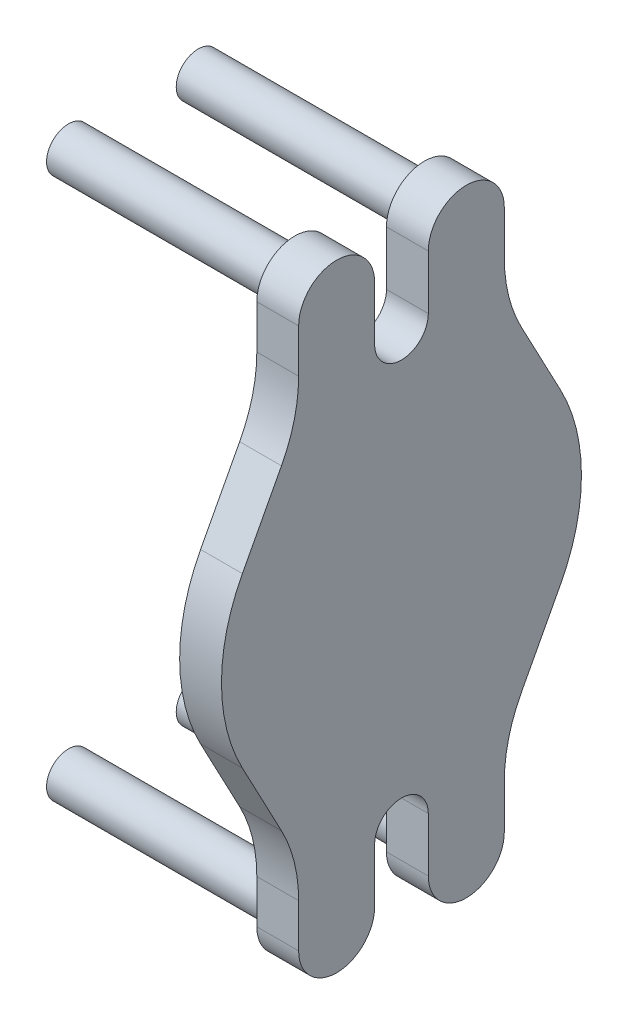
ISO-10303-21;
HEADER;
FILE_DESCRIPTION(('STEP AP214'),'2;1');
FILE_NAME('part.step','',(''),(''),'','','');
FILE_SCHEMA(('AUTOMOTIVE_DESIGN { 1 0 10303 214 1 1 1 1 }'));
ENDSEC;
DATA;
#1=APPLICATION_CONTEXT('core data for automotive mechanical design processes');
#2=APPLICATION_PROTOCOL_DEFINITION('international standard','automotive_design',2000,#1);
#3=PRODUCT_CONTEXT('',#1,'mechanical');
#4=PRODUCT('Part','Part','',(#3));
#5=PRODUCT_RELATED_PRODUCT_CATEGORY('part','',(#4));
#6=PRODUCT_DEFINITION_FORMATION('','',#4);
#7=PRODUCT_DEFINITION_CONTEXT('part definition',#1,'design');
#8=PRODUCT_DEFINITION('design','',#6,#7);
#9=PRODUCT_DEFINITION_SHAPE('','',#8);
#10=(LENGTH_UNIT() NAMED_UNIT(*) SI_UNIT(.MILLI.,.METRE.));
#11=(NAMED_UNIT(*) PLANE_ANGLE_UNIT() SI_UNIT($,.RADIAN.));
#12=(NAMED_UNIT(*) SI_UNIT($,.STERADIAN.) SOLID_ANGLE_UNIT());
#13=UNCERTAINTY_MEASURE_WITH_UNIT(LENGTH_MEASURE(1.E-05),#10,'distance_accuracy_value','');
#14=(GEOMETRIC_REPRESENTATION_CONTEXT(3) GLOBAL_UNCERTAINTY_ASSIGNED_CONTEXT((#13)) GLOBAL_UNIT_ASSIGNED_CONTEXT((#10,
#11,#12)) REPRESENTATION_CONTEXT('',''));
#15=CARTESIAN_POINT('',(0.,0.,0.));
#16=DIRECTION('',(0.,0.,1.));
#17=DIRECTION('',(1.,0.,0.));
#18=AXIS2_PLACEMENT_3D('',#15,#16,#17);
#19=CARTESIAN_POINT('',(33.9,17.1151545626375,32.3245303182742));
#20=DIRECTION('',(0.,-0.467934015820141,-0.883763405464628));
#21=DIRECTION('',(0.,0.883763405464628,-0.467934015820141));
#22=AXIS2_PLACEMENT_3D('',#19,#20,#21);
#23=PLANE('',#22);
#24=DIRECTION('',(0.,-0.883763405464628,0.467934015820141));
#25=VECTOR('',#24,1.);
#26=CARTESIAN_POINT('',(25.4,17.1151545626375,32.3245303182742));
#27=LINE('',#26,#25);
#28=CARTESIAN_POINT('',(25.4,32.1151545626375,24.3823478360612));
#29=VERTEX_POINT('',#28);
#30=CARTESIAN_POINT('',(25.4,17.1151545626375,32.3245303182742));
#31=VERTEX_POINT('',#30);
#32=EDGE_CURVE('E229',#29,#31,#27,.T.);
#33=ORIENTED_EDGE('',*,*,#32,.T.);
#34=DIRECTION('',(-1.,0.,0.));
#35=VECTOR('',#34,1.);
#36=CARTESIAN_POINT('',(33.9,17.1151545626375,32.3245303182742));
#37=LINE('',#36,#35);
#38=CARTESIAN_POINT('',(33.9,17.1151545626375,32.3245303182742));
#39=VERTEX_POINT('',#38);
#40=EDGE_CURVE('E338',#39,#31,#37,.T.);
#41=ORIENTED_EDGE('',*,*,#40,.F.);
#42=DIRECTION('',(0.,-0.883763405464628,0.467934015820141));
#43=VECTOR('',#42,1.);
#44=CARTESIAN_POINT('',(33.9,17.1151545626375,32.3245303182742));
#45=LINE('',#44,#43);
#46=CARTESIAN_POINT('',(33.9,32.1151545626375,24.3823478360612));
#47=VERTEX_POINT('',#46);
#48=EDGE_CURVE('E288',#47,#39,#45,.T.);
#49=ORIENTED_EDGE('',*,*,#48,.F.);
#50=DIRECTION('',(-1.,0.,0.));
#51=VECTOR('',#50,1.);
#52=CARTESIAN_POINT('',(33.9,32.1151545626375,24.3823478360612));
#53=LINE('',#52,#51);
#54=EDGE_CURVE('E225',#47,#29,#53,.T.);
#55=ORIENTED_EDGE('',*,*,#54,.T.);
#56=EDGE_LOOP('',(#33,#41,#49,#55));
#57=FACE_BOUND('',#56,.T.);
#58=ADVANCED_FACE('F35',(#57),#23,.F.);
#59=CARTESIAN_POINT('',(33.9,0.,0.));
#60=DIRECTION('',(-1.,0.,0.));
#61=DIRECTION('',(0.,-1.,0.));
#62=AXIS2_PLACEMENT_3D('',#59,#60,#61);
#63=CYLINDRICAL_SURFACE('',#62,36.576);
#64=CARTESIAN_POINT('',(25.4,0.,0.));
#65=DIRECTION('',(1.,0.,0.));
#66=DIRECTION('',(0.,1.,0.));
#67=AXIS2_PLACEMENT_3D('',#64,#65,#66);
#68=CIRCLE('',#67,36.576);
#69=CARTESIAN_POINT('',(25.4,-17.1151545626375,32.3245303182742));
#70=VERTEX_POINT('',#69);
#71=EDGE_CURVE('E232',#31,#70,#68,.T.);
#72=ORIENTED_EDGE('',*,*,#71,.T.);
#73=DIRECTION('',(-1.,0.,0.));
#74=VECTOR('',#73,1.);
#75=CARTESIAN_POINT('',(33.9,-17.1151545626374,32.3245303182742));
#76=LINE('',#75,#74);
#77=CARTESIAN_POINT('',(33.9,-17.1151545626374,32.3245303182742));
#78=VERTEX_POINT('',#77);
#79=EDGE_CURVE('E336',#78,#70,#76,.T.);
#80=ORIENTED_EDGE('',*,*,#79,.F.);
#81=CARTESIAN_POINT('',(33.9,0.,0.));
#82=DIRECTION('',(1.,0.,0.));
#83=DIRECTION('',(0.,1.,0.));
#84=AXIS2_PLACEMENT_3D('',#81,#82,#83);
#85=CIRCLE('',#84,36.576);
#86=EDGE_CURVE('E144',#39,#78,#85,.T.);
#87=ORIENTED_EDGE('',*,*,#86,.F.);
#88=ORIENTED_EDGE('',*,*,#40,.T.);
#89=EDGE_LOOP('',(#72,#80,#87,#88));
#90=FACE_BOUND('',#89,.T.);
#91=ADVANCED_FACE('F375',(#90),#63,.T.);
#92=CARTESIAN_POINT('',(33.9,-17.1151545626375,32.3245303182742));
#93=DIRECTION('',(0.,-0.467934015820141,0.883763405464628));
#94=DIRECTION('',(0.,-0.883763405464628,-0.467934015820141));
#95=AXIS2_PLACEMENT_3D('',#92,#93,#94);
#96=PLANE('',#95);
#97=DIRECTION('',(0.,0.883763405464628,0.467934015820141));
#98=VECTOR('',#97,1.);
#99=CARTESIAN_POINT('',(25.4,-17.1151545626375,32.3245303182742));
#100=LINE('',#99,#98);
#101=CARTESIAN_POINT('',(25.4,-32.1151545626375,24.3823478360612));
#102=VERTEX_POINT('',#101);
#103=EDGE_CURVE('E236',#102,#70,#100,.T.);
#104=ORIENTED_EDGE('',*,*,#103,.F.);
#105=DIRECTION('',(-1.,0.,0.));
#106=VECTOR('',#105,1.);
#107=CARTESIAN_POINT('',(33.9,-32.1151545626374,24.3823478360612));
#108=LINE('',#107,#106);
#109=CARTESIAN_POINT('',(33.9,-32.1151545626374,24.3823478360612));
#110=VERTEX_POINT('',#109);
#111=EDGE_CURVE('E334',#110,#102,#108,.T.);
#112=ORIENTED_EDGE('',*,*,#111,.F.);
#113=DIRECTION('',(0.,0.883763405464628,0.467934015820141));
#114=VECTOR('',#113,1.);
#115=CARTESIAN_POINT('',(33.9,-17.1151545626375,32.3245303182742));
#116=LINE('',#115,#114);
#117=EDGE_CURVE('E604',#110,#78,#116,.T.);
#118=ORIENTED_EDGE('',*,*,#117,.T.);
#119=ORIENTED_EDGE('',*,*,#79,.T.);
#120=EDGE_LOOP('',(#104,#112,#118,#119));
#121=FACE_BOUND('',#120,.T.);
#122=ADVANCED_FACE('F379',(#121),#96,.T.);
#123=CARTESIAN_POINT('',(33.9,-46.1531750372417,50.89525));
#124=DIRECTION('',(-1.,0.,0.));
#125=DIRECTION('',(0.,-1.,0.));
#126=AXIS2_PLACEMENT_3D('',#123,#124,#125);
#127=CYLINDRICAL_SURFACE('',#126,30.);
#128=CARTESIAN_POINT('',(25.4,-46.1531750372417,50.89525));
#129=DIRECTION('',(1.,0.,0.));
#130=DIRECTION('',(0.,1.,0.));
#131=AXIS2_PLACEMENT_3D('',#128,#129,#130);
#132=CIRCLE('',#131,30.);
#133=CARTESIAN_POINT('',(25.4,-46.1531750372417,20.89525));
#134=VERTEX_POINT('',#133);
#135=EDGE_CURVE('E239',#134,#102,#132,.T.);
#136=ORIENTED_EDGE('',*,*,#135,.F.);
#137=DIRECTION('',(-1.,0.,0.));
#138=VECTOR('',#137,1.);
#139=CARTESIAN_POINT('',(33.9,-46.1531750372417,20.89525));
#140=LINE('',#139,#138);
#141=CARTESIAN_POINT('',(33.9,-46.1531750372417,20.89525));
#142=VERTEX_POINT('',#141);
#143=EDGE_CURVE('E332',#142,#134,#140,.T.);
#144=ORIENTED_EDGE('',*,*,#143,.F.);
#145=CARTESIAN_POINT('',(33.9,-46.1531750372417,50.89525));
#146=DIRECTION('',(1.,0.,0.));
#147=DIRECTION('',(0.,1.,0.));
#148=AXIS2_PLACEMENT_3D('',#145,#146,#147);
#149=CIRCLE('',#148,30.);
#150=EDGE_CURVE('E607',#142,#110,#149,.T.);
#151=ORIENTED_EDGE('',*,*,#150,.T.);
#152=ORIENTED_EDGE('',*,*,#111,.T.);
#153=EDGE_LOOP('',(#136,#144,#151,#152));
#154=FACE_BOUND('',#153,.T.);
#155=ADVANCED_FACE('F383',(#154),#127,.F.);
#156=CARTESIAN_POINT('',(33.9,0.,20.89525));
#157=DIRECTION('',(0.,0.,1.));
#158=DIRECTION('',(0.,-1.,0.));
#159=AXIS2_PLACEMENT_3D('',#156,#157,#158);
#160=PLANE('',#159);
#161=DIRECTION('',(0.,1.,0.));
#162=VECTOR('',#161,1.);
#163=CARTESIAN_POINT('',(25.4,0.,20.89525));
#164=LINE('',#163,#162);
#165=CARTESIAN_POINT('',(25.4,-55.,20.89525));
#166=VERTEX_POINT('',#165);
#167=EDGE_CURVE('E242',#166,#134,#164,.T.);
#168=ORIENTED_EDGE('',*,*,#167,.F.);
#169=DIRECTION('',(-1.,0.,0.));
#170=VECTOR('',#169,1.);
#171=CARTESIAN_POINT('',(33.9,-55.,20.89525));
#172=LINE('',#171,#170);
#173=CARTESIAN_POINT('',(33.9,-55.,20.89525));
#174=VERTEX_POINT('',#173);
#175=EDGE_CURVE('E330',#174,#166,#172,.T.);
#176=ORIENTED_EDGE('',*,*,#175,.F.);
#177=DIRECTION('',(0.,1.,0.));
#178=VECTOR('',#177,1.);
#179=CARTESIAN_POINT('',(33.9,0.,20.89525));
#180=LINE('',#179,#178);
#181=EDGE_CURVE('E610',#174,#142,#180,.T.);
#182=ORIENTED_EDGE('',*,*,#181,.T.);
#183=ORIENTED_EDGE('',*,*,#143,.T.);
#184=EDGE_LOOP('',(#168,#176,#182,#183));
#185=FACE_BOUND('',#184,.T.);
#186=ADVANCED_FACE('F389',(#185),#160,.T.);
#187=CARTESIAN_POINT('',(33.9,-55.,13.175));
#188=DIRECTION('',(-1.,0.,0.));
#189=DIRECTION('',(0.,-1.,0.));
#190=AXIS2_PLACEMENT_3D('',#187,#188,#189);
#191=CYLINDRICAL_SURFACE('',#190,7.72025);
#192=CARTESIAN_POINT('',(25.4,-55.,13.175));
#193=DIRECTION('',(1.,0.,0.));
#194=DIRECTION('',(0.,1.,0.));
#195=AXIS2_PLACEMENT_3D('',#192,#193,#194);
#196=CIRCLE('',#195,7.72025);
#197=CARTESIAN_POINT('',(25.4,-55.,5.45475));
#198=VERTEX_POINT('',#197);
#199=EDGE_CURVE('E245',#166,#198,#196,.T.);
#200=ORIENTED_EDGE('',*,*,#199,.T.);
#201=DIRECTION('',(-1.,0.,0.));
#202=VECTOR('',#201,1.);
#203=CARTESIAN_POINT('',(33.9,-55.,5.45475));
#204=LINE('',#203,#202);
#205=CARTESIAN_POINT('',(33.9,-55.,5.45475));
#206=VERTEX_POINT('',#205);
#207=EDGE_CURVE('E327',#206,#198,#204,.T.);
#208=ORIENTED_EDGE('',*,*,#207,.F.);
#209=CARTESIAN_POINT('',(33.9,-55.,13.175));
#210=DIRECTION('',(1.,0.,0.));
#211=DIRECTION('',(0.,1.,0.));
#212=AXIS2_PLACEMENT_3D('',#209,#210,#211);
#213=CIRCLE('',#212,7.72025);
#214=EDGE_CURVE('E613',#174,#206,#213,.T.);
#215=ORIENTED_EDGE('',*,*,#214,.F.);
#216=ORIENTED_EDGE('',*,*,#175,.T.);
#217=EDGE_LOOP('',(#200,#208,#215,#216));
#218=FACE_BOUND('',#217,.T.);
#219=ADVANCED_FACE('F393',(#218),#191,.T.);
#220=CARTESIAN_POINT('',(33.9,0.,5.45475000000001));
#221=DIRECTION('',(0.,0.,1.));
#222=DIRECTION('',(0.,-1.,0.));
#223=AXIS2_PLACEMENT_3D('',#220,#221,#222);
#224=PLANE('',#223);
#225=DIRECTION('',(0.,1.,0.));
#226=VECTOR('',#225,1.);
#227=CARTESIAN_POINT('',(25.4,0.,5.45475000000001));
#228=LINE('',#227,#226);
#229=CARTESIAN_POINT('',(25.4,-44.,5.45475));
#230=VERTEX_POINT('',#229);
#231=EDGE_CURVE('E247',#198,#230,#228,.T.);
#232=ORIENTED_EDGE('',*,*,#231,.T.);
#233=DIRECTION('',(-1.,0.,0.));
#234=VECTOR('',#233,1.);
#235=CARTESIAN_POINT('',(33.9,-44.,5.45475));
#236=LINE('',#235,#234);
#237=CARTESIAN_POINT('',(33.9,-44.,5.45475));
#238=VERTEX_POINT('',#237);
#239=EDGE_CURVE('E324',#238,#230,#236,.T.);
#240=ORIENTED_EDGE('',*,*,#239,.F.);
#241=DIRECTION('',(0.,1.,0.));
#242=VECTOR('',#241,1.);
#243=CARTESIAN_POINT('',(33.9,0.,5.45475000000001));
#244=LINE('',#243,#242);
#245=EDGE_CURVE('E615',#206,#238,#244,.T.);
#246=ORIENTED_EDGE('',*,*,#245,.F.);
#247=ORIENTED_EDGE('',*,*,#207,.T.);
#248=EDGE_LOOP('',(#232,#240,#246,#247));
#249=FACE_BOUND('',#248,.T.);
#250=ADVANCED_FACE('F397',(#249),#224,.F.);
#251=CARTESIAN_POINT('',(33.9,-44.,0.));
#252=DIRECTION('',(-1.,0.,0.));
#253=DIRECTION('',(0.,-1.,0.));
#254=AXIS2_PLACEMENT_3D('',#251,#252,#253);
#255=CYLINDRICAL_SURFACE('',#254,5.45475);
#256=CARTESIAN_POINT('',(25.4,-44.,0.));
#257=DIRECTION('',(1.,0.,0.));
#258=DIRECTION('',(0.,1.,0.));
#259=AXIS2_PLACEMENT_3D('',#256,#257,#258);
#260=CIRCLE('',#259,5.45475);
#261=CARTESIAN_POINT('',(25.4,-44.,-5.45474999999999));
#262=VERTEX_POINT('',#261);
#263=EDGE_CURVE('E249',#230,#262,#260,.F.);
#264=ORIENTED_EDGE('',*,*,#263,.T.);
#265=DIRECTION('',(-1.,0.,0.));
#266=VECTOR('',#265,1.);
#267=CARTESIAN_POINT('',(33.9,-44.,-5.45474999999999));
#268=LINE('',#267,#266);
#269=CARTESIAN_POINT('',(33.9,-44.,-5.45474999999999));
#270=VERTEX_POINT('',#269);
#271=EDGE_CURVE('E321',#270,#262,#268,.T.);
#272=ORIENTED_EDGE('',*,*,#271,.F.);
#273=CARTESIAN_POINT('',(33.9,-44.,0.));
#274=DIRECTION('',(1.,0.,0.));
#275=DIRECTION('',(0.,1.,0.));
#276=AXIS2_PLACEMENT_3D('',#273,#274,#275);
#277=CIRCLE('',#276,5.45475);
#278=EDGE_CURVE('E617',#238,#270,#277,.F.);
#279=ORIENTED_EDGE('',*,*,#278,.F.);
#280=ORIENTED_EDGE('',*,*,#239,.T.);
#281=EDGE_LOOP('',(#264,#272,#279,#280));
#282=FACE_BOUND('',#281,.T.);
#283=ADVANCED_FACE('F401',(#282),#255,.F.);
#284=CARTESIAN_POINT('',(33.9,0.,-5.45474999999999));
#285=DIRECTION('',(0.,0.,-1.));
#286=DIRECTION('',(0.,1.,0.));
#287=AXIS2_PLACEMENT_3D('',#284,#285,#286);
#288=PLANE('',#287);
#289=DIRECTION('',(0.,-1.,0.));
#290=VECTOR('',#289,1.);
#291=CARTESIAN_POINT('',(25.4,0.,-5.45474999999999));
#292=LINE('',#291,#290);
#293=CARTESIAN_POINT('',(25.4,-55.,-5.45474999999999));
#294=VERTEX_POINT('',#293);
#295=EDGE_CURVE('E251',#262,#294,#292,.T.);
#296=ORIENTED_EDGE('',*,*,#295,.T.);
#297=DIRECTION('',(-1.,0.,0.));
#298=VECTOR('',#297,1.);
#299=CARTESIAN_POINT('',(33.9,-55.,-5.45474999999999));
#300=LINE('',#299,#298);
#301=CARTESIAN_POINT('',(33.9,-55.,-5.45474999999999));
#302=VERTEX_POINT('',#301);
#303=EDGE_CURVE('E318',#302,#294,#300,.T.);
#304=ORIENTED_EDGE('',*,*,#303,.F.);
#305=DIRECTION('',(0.,-1.,0.));
#306=VECTOR('',#305,1.);
#307=CARTESIAN_POINT('',(33.9,0.,-5.45474999999999));
#308=LINE('',#307,#306);
#309=EDGE_CURVE('E619',#270,#302,#308,.T.);
#310=ORIENTED_EDGE('',*,*,#309,.F.);
#311=ORIENTED_EDGE('',*,*,#271,.T.);
#312=EDGE_LOOP('',(#296,#304,#310,#311));
#313=FACE_BOUND('',#312,.T.);
#314=ADVANCED_FACE('F405',(#313),#288,.F.);
#315=CARTESIAN_POINT('',(33.9,-55.,-13.175));
#316=DIRECTION('',(-1.,0.,0.));
#317=DIRECTION('',(0.,-1.,0.));
#318=AXIS2_PLACEMENT_3D('',#315,#316,#317);
#319=CYLINDRICAL_SURFACE('',#318,7.72025);
#320=CARTESIAN_POINT('',(25.4,-55.,-13.175));
#321=DIRECTION('',(1.,0.,0.));
#322=DIRECTION('',(0.,1.,0.));
#323=AXIS2_PLACEMENT_3D('',#320,#321,#322);
#324=CIRCLE('',#323,7.72025);
#325=CARTESIAN_POINT('',(25.4,-55.,-20.89525));
#326=VERTEX_POINT('',#325);
#327=EDGE_CURVE('E253',#294,#326,#324,.T.);
#328=ORIENTED_EDGE('',*,*,#327,.T.);
#329=DIRECTION('',(-1.,0.,0.));
#330=VECTOR('',#329,1.);
#331=CARTESIAN_POINT('',(33.9,-55.,-20.89525));
#332=LINE('',#331,#330);
#333=CARTESIAN_POINT('',(33.9,-55.,-20.89525));
#334=VERTEX_POINT('',#333);
#335=EDGE_CURVE('E315',#334,#326,#332,.T.);
#336=ORIENTED_EDGE('',*,*,#335,.F.);
#337=CARTESIAN_POINT('',(33.9,-55.,-13.175));
#338=DIRECTION('',(1.,0.,0.));
#339=DIRECTION('',(0.,1.,0.));
#340=AXIS2_PLACEMENT_3D('',#337,#338,#339);
#341=CIRCLE('',#340,7.72025);
#342=EDGE_CURVE('E621',#302,#334,#341,.T.);
#343=ORIENTED_EDGE('',*,*,#342,.F.);
#344=ORIENTED_EDGE('',*,*,#303,.T.);
#345=EDGE_LOOP('',(#328,#336,#343,#344));
#346=FACE_BOUND('',#345,.T.);
#347=ADVANCED_FACE('F409',(#346),#319,.T.);
#348=CARTESIAN_POINT('',(33.9,0.,-20.89525));
#349=DIRECTION('',(0.,0.,1.));
#350=DIRECTION('',(1.,0.,0.));
#351=AXIS2_PLACEMENT_3D('',#348,#349,#350);
#352=PLANE('',#351);
#353=DIRECTION('',(0.,1.,0.));
#354=VECTOR('',#353,1.);
#355=CARTESIAN_POINT('',(25.4,0.,-20.89525));
#356=LINE('',#355,#354);
#357=CARTESIAN_POINT('',(25.4,-46.1531750372417,-20.89525));
#358=VERTEX_POINT('',#357);
#359=EDGE_CURVE('E255',#326,#358,#356,.T.);
#360=ORIENTED_EDGE('',*,*,#359,.T.);
#361=DIRECTION('',(-1.,0.,0.));
#362=VECTOR('',#361,1.);
#363=CARTESIAN_POINT('',(33.9,-46.1531750372417,-20.89525));
#364=LINE('',#363,#362);
#365=CARTESIAN_POINT('',(33.9,-46.1531750372417,-20.89525));
#366=VERTEX_POINT('',#365);
#367=EDGE_CURVE('E312',#366,#358,#364,.T.);
#368=ORIENTED_EDGE('',*,*,#367,.F.);
#369=DIRECTION('',(0.,1.,0.));
#370=VECTOR('',#369,1.);
#371=CARTESIAN_POINT('',(33.9,0.,-20.89525));
#372=LINE('',#371,#370);
#373=EDGE_CURVE('E623',#334,#366,#372,.T.);
#374=ORIENTED_EDGE('',*,*,#373,.F.);
#375=ORIENTED_EDGE('',*,*,#335,.T.);
#376=EDGE_LOOP('',(#360,#368,#374,#375));
#377=FACE_BOUND('',#376,.T.);
#378=ADVANCED_FACE('F413',(#377),#352,.F.);
#379=CARTESIAN_POINT('',(33.9,-46.1531750372417,-50.89525));
#380=DIRECTION('',(-1.,0.,0.));
#381=DIRECTION('',(0.,-1.,0.));
#382=AXIS2_PLACEMENT_3D('',#379,#380,#381);
#383=CYLINDRICAL_SURFACE('',#382,30.);
#384=CARTESIAN_POINT('',(25.4,-46.1531750372417,-50.89525));
#385=DIRECTION('',(1.,0.,0.));
#386=DIRECTION('',(0.,1.,0.));
#387=AXIS2_PLACEMENT_3D('',#384,#385,#386);
#388=CIRCLE('',#387,30.);
#389=CARTESIAN_POINT('',(25.4,-32.1151545626375,-24.3823478360612));
#390=VERTEX_POINT('',#389);
#391=EDGE_CURVE('E257',#358,#390,#388,.F.);
#392=ORIENTED_EDGE('',*,*,#391,.T.);
#393=DIRECTION('',(-1.,0.,0.));
#394=VECTOR('',#393,1.);
#395=CARTESIAN_POINT('',(33.9,-32.1151545626375,-24.3823478360612));
#396=LINE('',#395,#394);
#397=CARTESIAN_POINT('',(33.9,-32.1151545626375,-24.3823478360612));
#398=VERTEX_POINT('',#397);
#399=EDGE_CURVE('E309',#398,#390,#396,.T.);
#400=ORIENTED_EDGE('',*,*,#399,.F.);
#401=CARTESIAN_POINT('',(33.9,-46.1531750372417,-50.89525));
#402=DIRECTION('',(1.,0.,0.));
#403=DIRECTION('',(0.,1.,0.));
#404=AXIS2_PLACEMENT_3D('',#401,#402,#403);
#405=CIRCLE('',#404,30.);
#406=EDGE_CURVE('E625',#366,#398,#405,.F.);
#407=ORIENTED_EDGE('',*,*,#406,.F.);
#408=ORIENTED_EDGE('',*,*,#367,.T.);
#409=EDGE_LOOP('',(#392,#400,#407,#408));
#410=FACE_BOUND('',#409,.T.);
#411=ADVANCED_FACE('F417',(#410),#383,.F.);
#412=CARTESIAN_POINT('',(33.9,-17.1151545626375,-32.3245303182742));
#413=DIRECTION('',(0.,0.467934015820141,0.883763405464628));
#414=DIRECTION('',(0.,-0.883763405464628,0.467934015820141));
#415=AXIS2_PLACEMENT_3D('',#412,#413,#414);
#416=PLANE('',#415);
#417=DIRECTION('',(0.,0.883763405464628,-0.467934015820141));
#418=VECTOR('',#417,1.);
#419=CARTESIAN_POINT('',(25.4,-17.1151545626375,-32.3245303182742));
#420=LINE('',#419,#418);
#421=CARTESIAN_POINT('',(25.4,-17.1151545626375,-32.3245303182742));
#422=VERTEX_POINT('',#421);
#423=EDGE_CURVE('E259',#390,#422,#420,.T.);
#424=ORIENTED_EDGE('',*,*,#423,.T.);
#425=DIRECTION('',(-1.,0.,0.));
#426=VECTOR('',#425,1.);
#427=CARTESIAN_POINT('',(33.9,-17.1151545626375,-32.3245303182742));
#428=LINE('',#427,#426);
#429=CARTESIAN_POINT('',(33.9,-17.1151545626375,-32.3245303182742));
#430=VERTEX_POINT('',#429);
#431=EDGE_CURVE('E306',#430,#422,#428,.T.);
#432=ORIENTED_EDGE('',*,*,#431,.F.);
#433=DIRECTION('',(0.,0.883763405464628,-0.467934015820141));
#434=VECTOR('',#433,1.);
#435=CARTESIAN_POINT('',(33.9,-17.1151545626375,-32.3245303182742));
#436=LINE('',#435,#434);
#437=EDGE_CURVE('E627',#398,#430,#436,.T.);
#438=ORIENTED_EDGE('',*,*,#437,.F.);
#439=ORIENTED_EDGE('',*,*,#399,.T.);
#440=EDGE_LOOP('',(#424,#432,#438,#439));
#441=FACE_BOUND('',#440,.T.);
#442=ADVANCED_FACE('F421',(#441),#416,.F.);
#443=CARTESIAN_POINT('',(33.9,0.,0.));
#444=DIRECTION('',(-1.,0.,0.));
#445=DIRECTION('',(0.,-1.,0.));
#446=AXIS2_PLACEMENT_3D('',#443,#444,#445);
#447=CYLINDRICAL_SURFACE('',#446,36.576);
#448=CARTESIAN_POINT('',(25.4,0.,0.));
#449=DIRECTION('',(1.,0.,0.));
#450=DIRECTION('',(0.,1.,0.));
#451=AXIS2_PLACEMENT_3D('',#448,#449,#450);
#452=CIRCLE('',#451,36.576);
#453=CARTESIAN_POINT('',(25.4,17.1151545626375,-32.3245303182742));
#454=VERTEX_POINT('',#453);
#455=EDGE_CURVE('E261',#422,#454,#452,.T.);
#456=ORIENTED_EDGE('',*,*,#455,.T.);
#457=DIRECTION('',(-1.,0.,0.));
#458=VECTOR('',#457,1.);
#459=CARTESIAN_POINT('',(33.9,17.1151545626375,-32.3245303182742));
#460=LINE('',#459,#458);
#461=CARTESIAN_POINT('',(33.9,17.1151545626375,-32.3245303182742));
#462=VERTEX_POINT('',#461);
#463=EDGE_CURVE('E304',#462,#454,#460,.T.);
#464=ORIENTED_EDGE('',*,*,#463,.F.);
#465=CARTESIAN_POINT('',(33.9,0.,0.));
#466=DIRECTION('',(1.,0.,0.));
#467=DIRECTION('',(0.,1.,0.));
#468=AXIS2_PLACEMENT_3D('',#465,#466,#467);
#469=CIRCLE('',#468,36.576);
#470=EDGE_CURVE('E629',#430,#462,#469,.T.);
#471=ORIENTED_EDGE('',*,*,#470,.F.);
#472=ORIENTED_EDGE('',*,*,#431,.T.);
#473=EDGE_LOOP('',(#456,#464,#471,#472));
#474=FACE_BOUND('',#473,.T.);
#475=ADVANCED_FACE('F425',(#474),#447,.T.);
#476=CARTESIAN_POINT('',(33.9,17.1151545626375,-32.3245303182742));
#477=DIRECTION('',(0.,0.467934015820141,-0.883763405464628));
#478=DIRECTION('',(0.,0.883763405464628,0.467934015820141));
#479=AXIS2_PLACEMENT_3D('',#476,#477,#478);
#480=PLANE('',#479);
#481=DIRECTION('',(0.,-0.883763405464628,-0.467934015820141));
#482=VECTOR('',#481,1.);
#483=CARTESIAN_POINT('',(25.4,17.1151545626375,-32.3245303182742));
#484=LINE('',#483,#482);
#485=CARTESIAN_POINT('',(25.4,32.1151545626375,-24.3823478360612));
#486=VERTEX_POINT('',#485);
#487=EDGE_CURVE('E264',#486,#454,#484,.T.);
#488=ORIENTED_EDGE('',*,*,#487,.F.);
#489=DIRECTION('',(-1.,0.,0.));
#490=VECTOR('',#489,1.);
#491=CARTESIAN_POINT('',(33.9,32.1151545626375,-24.3823478360612));
#492=LINE('',#491,#490);
#493=CARTESIAN_POINT('',(33.9,32.1151545626375,-24.3823478360612));
#494=VERTEX_POINT('',#493);
#495=EDGE_CURVE('E302',#494,#486,#492,.T.);
#496=ORIENTED_EDGE('',*,*,#495,.F.);
#497=DIRECTION('',(0.,-0.883763405464628,-0.467934015820141));
#498=VECTOR('',#497,1.);
#499=CARTESIAN_POINT('',(33.9,17.1151545626375,-32.3245303182742));
#500=LINE('',#499,#498);
#501=EDGE_CURVE('E631',#494,#462,#500,.T.);
#502=ORIENTED_EDGE('',*,*,#501,.T.);
#503=ORIENTED_EDGE('',*,*,#463,.T.);
#504=EDGE_LOOP('',(#488,#496,#502,#503));
#505=FACE_BOUND('',#504,.T.);
#506=ADVANCED_FACE('F429',(#505),#480,.T.);
#507=CARTESIAN_POINT('',(33.9,46.1531750372417,-50.89525));
#508=DIRECTION('',(-1.,0.,0.));
#509=DIRECTION('',(0.,-1.,0.));
#510=AXIS2_PLACEMENT_3D('',#507,#508,#509);
#511=CYLINDRICAL_SURFACE('',#510,30.);
#512=CARTESIAN_POINT('',(25.4,46.1531750372417,-50.89525));
#513=DIRECTION('',(1.,0.,0.));
#514=DIRECTION('',(0.,1.,0.));
#515=AXIS2_PLACEMENT_3D('',#512,#513,#514);
#516=CIRCLE('',#515,30.);
#517=CARTESIAN_POINT('',(25.4,46.1531750372417,-20.89525));
#518=VERTEX_POINT('',#517);
#519=EDGE_CURVE('E267',#518,#486,#516,.T.);
#520=ORIENTED_EDGE('',*,*,#519,.F.);
#521=DIRECTION('',(-1.,0.,0.));
#522=VECTOR('',#521,1.);
#523=CARTESIAN_POINT('',(33.9,46.1531750372417,-20.89525));
#524=LINE('',#523,#522);
#525=CARTESIAN_POINT('',(33.9,46.1531750372417,-20.89525));
#526=VERTEX_POINT('',#525);
#527=EDGE_CURVE('E300',#526,#518,#524,.T.);
#528=ORIENTED_EDGE('',*,*,#527,.F.);
#529=CARTESIAN_POINT('',(33.9,46.1531750372417,-50.89525));
#530=DIRECTION('',(1.,0.,0.));
#531=DIRECTION('',(0.,1.,0.));
#532=AXIS2_PLACEMENT_3D('',#529,#530,#531);
#533=CIRCLE('',#532,30.);
#534=EDGE_CURVE('E634',#526,#494,#533,.T.);
#535=ORIENTED_EDGE('',*,*,#534,.T.);
#536=ORIENTED_EDGE('',*,*,#495,.T.);
#537=EDGE_LOOP('',(#520,#528,#535,#536));
#538=FACE_BOUND('',#537,.T.);
#539=ADVANCED_FACE('F433',(#538),#511,.F.);
#540=CARTESIAN_POINT('',(33.9,0.,-20.89525));
#541=DIRECTION('',(0.,0.,-1.));
#542=DIRECTION('',(-1.,0.,0.));
#543=AXIS2_PLACEMENT_3D('',#540,#541,#542);
#544=PLANE('',#543);
#545=DIRECTION('',(0.,-1.,0.));
#546=VECTOR('',#545,1.);
#547=CARTESIAN_POINT('',(25.4,0.,-20.89525));
#548=LINE('',#547,#546);
#549=CARTESIAN_POINT('',(25.4,55.,-20.89525));
#550=VERTEX_POINT('',#549);
#551=EDGE_CURVE('E270',#550,#518,#548,.T.);
#552=ORIENTED_EDGE('',*,*,#551,.F.);
#553=DIRECTION('',(-1.,0.,0.));
#554=VECTOR('',#553,1.);
#555=CARTESIAN_POINT('',(33.9,55.,-20.89525));
#556=LINE('',#555,#554);
#557=CARTESIAN_POINT('',(33.9,55.,-20.89525));
#558=VERTEX_POINT('',#557);
#559=EDGE_CURVE('E298',#558,#550,#556,.T.);
#560=ORIENTED_EDGE('',*,*,#559,.F.);
#561=DIRECTION('',(0.,-1.,0.));
#562=VECTOR('',#561,1.);
#563=CARTESIAN_POINT('',(33.9,0.,-20.89525));
#564=LINE('',#563,#562);
#565=EDGE_CURVE('E637',#558,#526,#564,.T.);
#566=ORIENTED_EDGE('',*,*,#565,.T.);
#567=ORIENTED_EDGE('',*,*,#527,.T.);
#568=EDGE_LOOP('',(#552,#560,#566,#567));
#569=FACE_BOUND('',#568,.T.);
#570=ADVANCED_FACE('F437',(#569),#544,.T.);
#571=CARTESIAN_POINT('',(33.9,55.,-13.175));
#572=DIRECTION('',(-1.,0.,0.));
#573=DIRECTION('',(0.,-1.,0.));
#574=AXIS2_PLACEMENT_3D('',#571,#572,#573);
#575=CYLINDRICAL_SURFACE('',#574,7.72025);
#576=CARTESIAN_POINT('',(25.4,55.,-13.175));
#577=DIRECTION('',(1.,0.,0.));
#578=DIRECTION('',(0.,1.,0.));
#579=AXIS2_PLACEMENT_3D('',#576,#577,#578);
#580=CIRCLE('',#579,7.72025);
#581=CARTESIAN_POINT('',(25.4,55.,-5.45474999999999));
#582=VERTEX_POINT('',#581);
#583=EDGE_CURVE('E273',#550,#582,#580,.T.);
#584=ORIENTED_EDGE('',*,*,#583,.T.);
#585=DIRECTION('',(-1.,0.,0.));
#586=VECTOR('',#585,1.);
#587=CARTESIAN_POINT('',(33.9,55.,-5.45474999999999));
#588=LINE('',#587,#586);
#589=CARTESIAN_POINT('',(33.9,55.,-5.45474999999999));
#590=VERTEX_POINT('',#589);
#591=EDGE_CURVE('E296',#590,#582,#588,.T.);
#592=ORIENTED_EDGE('',*,*,#591,.F.);
#593=CARTESIAN_POINT('',(33.9,55.,-13.175));
#594=DIRECTION('',(1.,0.,0.));
#595=DIRECTION('',(0.,1.,0.));
#596=AXIS2_PLACEMENT_3D('',#593,#594,#595);
#597=CIRCLE('',#596,7.72025);
#598=EDGE_CURVE('E640',#558,#590,#597,.T.);
#599=ORIENTED_EDGE('',*,*,#598,.F.);
#600=ORIENTED_EDGE('',*,*,#559,.T.);
#601=EDGE_LOOP('',(#584,#592,#599,#600));
#602=FACE_BOUND('',#601,.T.);
#603=ADVANCED_FACE('F441',(#602),#575,.T.);
#604=CARTESIAN_POINT('',(33.9,0.,-5.45474999999999));
#605=DIRECTION('',(0.,0.,1.));
#606=DIRECTION('',(0.,-1.,0.));
#607=AXIS2_PLACEMENT_3D('',#604,#605,#606);
#608=PLANE('',#607);
#609=DIRECTION('',(0.,1.,0.));
#610=VECTOR('',#609,1.);
#611=CARTESIAN_POINT('',(25.4,0.,-5.45474999999999));
#612=LINE('',#611,#610);
#613=CARTESIAN_POINT('',(25.4,44.,-5.45474999999999));
#614=VERTEX_POINT('',#613);
#615=EDGE_CURVE('E276',#614,#582,#612,.T.);
#616=ORIENTED_EDGE('',*,*,#615,.F.);
#617=DIRECTION('',(-1.,0.,0.));
#618=VECTOR('',#617,1.);
#619=CARTESIAN_POINT('',(33.9,44.,-5.45474999999999));
#620=LINE('',#619,#618);
#621=CARTESIAN_POINT('',(33.9,44.,-5.45474999999999));
#622=VERTEX_POINT('',#621);
#623=EDGE_CURVE('E294',#622,#614,#620,.T.);
#624=ORIENTED_EDGE('',*,*,#623,.F.);
#625=DIRECTION('',(0.,1.,0.));
#626=VECTOR('',#625,1.);
#627=CARTESIAN_POINT('',(33.9,0.,-5.45474999999999));
#628=LINE('',#627,#626);
#629=EDGE_CURVE('E642',#622,#590,#628,.T.);
#630=ORIENTED_EDGE('',*,*,#629,.T.);
#631=ORIENTED_EDGE('',*,*,#591,.T.);
#632=EDGE_LOOP('',(#616,#624,#630,#631));
#633=FACE_BOUND('',#632,.T.);
#634=ADVANCED_FACE('F445',(#633),#608,.T.);
#635=CARTESIAN_POINT('',(33.9,44.,0.));
#636=DIRECTION('',(-1.,0.,0.));
#637=DIRECTION('',(0.,-1.,0.));
#638=AXIS2_PLACEMENT_3D('',#635,#636,#637);
#639=CYLINDRICAL_SURFACE('',#638,5.45475);
#640=CARTESIAN_POINT('',(25.4,44.,0.));
#641=DIRECTION('',(1.,0.,0.));
#642=DIRECTION('',(0.,1.,0.));
#643=AXIS2_PLACEMENT_3D('',#640,#641,#642);
#644=CIRCLE('',#643,5.45475);
#645=CARTESIAN_POINT('',(25.4,44.,5.45475));
#646=VERTEX_POINT('',#645);
#647=EDGE_CURVE('E279',#646,#614,#644,.T.);
#648=ORIENTED_EDGE('',*,*,#647,.F.);
#649=DIRECTION('',(-1.,0.,0.));
#650=VECTOR('',#649,1.);
#651=CARTESIAN_POINT('',(33.9,44.,5.45475));
#652=LINE('',#651,#650);
#653=CARTESIAN_POINT('',(33.9,44.,5.45475));
#654=VERTEX_POINT('',#653);
#655=EDGE_CURVE('E292',#654,#646,#652,.T.);
#656=ORIENTED_EDGE('',*,*,#655,.F.);
#657=CARTESIAN_POINT('',(33.9,44.,0.));
#658=DIRECTION('',(1.,0.,0.));
#659=DIRECTION('',(0.,1.,0.));
#660=AXIS2_PLACEMENT_3D('',#657,#658,#659);
#661=CIRCLE('',#660,5.45475);
#662=EDGE_CURVE('E645',#654,#622,#661,.T.);
#663=ORIENTED_EDGE('',*,*,#662,.T.);
#664=ORIENTED_EDGE('',*,*,#623,.T.);
#665=EDGE_LOOP('',(#648,#656,#663,#664));
#666=FACE_BOUND('',#665,.T.);
#667=ADVANCED_FACE('F449',(#666),#639,.F.);
#668=CARTESIAN_POINT('',(33.9,0.,5.45475000000001));
#669=DIRECTION('',(0.,0.,-1.));
#670=DIRECTION('',(0.,1.,0.));
#671=AXIS2_PLACEMENT_3D('',#668,#669,#670);
#672=PLANE('',#671);
#673=DIRECTION('',(0.,-1.,0.));
#674=VECTOR('',#673,1.);
#675=CARTESIAN_POINT('',(25.4,0.,5.45475000000001));
#676=LINE('',#675,#674);
#677=CARTESIAN_POINT('',(25.4,55.,5.45475));
#678=VERTEX_POINT('',#677);
#679=EDGE_CURVE('E282',#678,#646,#676,.T.);
#680=ORIENTED_EDGE('',*,*,#679,.F.);
#681=DIRECTION('',(-1.,0.,0.));
#682=VECTOR('',#681,1.);
#683=CARTESIAN_POINT('',(33.9,55.,5.45475));
#684=LINE('',#683,#682);
#685=CARTESIAN_POINT('',(33.9,55.,5.45475));
#686=VERTEX_POINT('',#685);
#687=EDGE_CURVE('E220',#686,#678,#684,.T.);
#688=ORIENTED_EDGE('',*,*,#687,.F.);
#689=DIRECTION('',(0.,-1.,0.));
#690=VECTOR('',#689,1.);
#691=CARTESIAN_POINT('',(33.9,0.,5.45475000000001));
#692=LINE('',#691,#690);
#693=EDGE_CURVE('E213',#686,#654,#692,.T.);
#694=ORIENTED_EDGE('',*,*,#693,.T.);
#695=ORIENTED_EDGE('',*,*,#655,.T.);
#696=EDGE_LOOP('',(#680,#688,#694,#695));
#697=FACE_BOUND('',#696,.T.);
#698=ADVANCED_FACE('F453',(#697),#672,.T.);
#699=CARTESIAN_POINT('',(33.9,55.,13.175));
#700=DIRECTION('',(-1.,0.,0.));
#701=DIRECTION('',(0.,-1.,0.));
#702=AXIS2_PLACEMENT_3D('',#699,#700,#701);
#703=CYLINDRICAL_SURFACE('',#702,7.72025);
#704=CARTESIAN_POINT('',(25.4,55.,13.175));
#705=DIRECTION('',(1.,0.,0.));
#706=DIRECTION('',(0.,1.,0.));
#707=AXIS2_PLACEMENT_3D('',#704,#705,#706);
#708=CIRCLE('',#707,7.72025);
#709=CARTESIAN_POINT('',(25.4,55.,20.89525));
#710=VERTEX_POINT('',#709);
#711=EDGE_CURVE('E219',#678,#710,#708,.T.);
#712=ORIENTED_EDGE('',*,*,#711,.T.);
#713=DIRECTION('',(-1.,0.,0.));
#714=VECTOR('',#713,1.);
#715=CARTESIAN_POINT('',(33.9,55.,20.89525));
#716=LINE('',#715,#714);
#717=CARTESIAN_POINT('',(33.9,55.,20.89525));
#718=VERTEX_POINT('',#717);
#719=EDGE_CURVE('E216',#718,#710,#716,.T.);
#720=ORIENTED_EDGE('',*,*,#719,.F.);
#721=CARTESIAN_POINT('',(33.9,55.,13.175));
#722=DIRECTION('',(1.,0.,0.));
#723=DIRECTION('',(0.,1.,0.));
#724=AXIS2_PLACEMENT_3D('',#721,#722,#723);
#725=CIRCLE('',#724,7.72025);
#726=EDGE_CURVE('E206',#686,#718,#725,.T.);
#727=ORIENTED_EDGE('',*,*,#726,.F.);
#728=ORIENTED_EDGE('',*,*,#687,.T.);
#729=EDGE_LOOP('',(#712,#720,#727,#728));
#730=FACE_BOUND('',#729,.T.);
#731=ADVANCED_FACE('F217',(#730),#703,.T.);
#732=CARTESIAN_POINT('',(33.9,0.,20.89525));
#733=DIRECTION('',(0.,0.,-1.));
#734=DIRECTION('',(0.,1.,0.));
#735=AXIS2_PLACEMENT_3D('',#732,#733,#734);
#736=PLANE('',#735);
#737=DIRECTION('',(0.,-1.,0.));
#738=VECTOR('',#737,1.);
#739=CARTESIAN_POINT('',(25.4,0.,20.89525));
#740=LINE('',#739,#738);
#741=CARTESIAN_POINT('',(25.4,46.1531750372417,20.89525));
#742=VERTEX_POINT('',#741);
#743=EDGE_CURVE('E129',#710,#742,#740,.T.);
#744=ORIENTED_EDGE('',*,*,#743,.T.);
#745=DIRECTION('',(-1.,0.,0.));
#746=VECTOR('',#745,1.);
#747=CARTESIAN_POINT('',(33.9,46.1531750372417,20.89525));
#748=LINE('',#747,#746);
#749=CARTESIAN_POINT('',(33.9,46.1531750372417,20.89525));
#750=VERTEX_POINT('',#749);
#751=EDGE_CURVE('E221',#750,#742,#748,.T.);
#752=ORIENTED_EDGE('',*,*,#751,.F.);
#753=DIRECTION('',(0.,-1.,0.));
#754=VECTOR('',#753,1.);
#755=CARTESIAN_POINT('',(33.9,0.,20.89525));
#756=LINE('',#755,#754);
#757=EDGE_CURVE('E210',#718,#750,#756,.T.);
#758=ORIENTED_EDGE('',*,*,#757,.F.);
#759=ORIENTED_EDGE('',*,*,#719,.T.);
#760=EDGE_LOOP('',(#744,#752,#758,#759));
#761=FACE_BOUND('',#760,.T.);
#762=ADVANCED_FACE('F223',(#761),#736,.F.);
#763=CARTESIAN_POINT('',(33.9,46.1531750372417,50.89525));
#764=DIRECTION('',(-1.,0.,0.));
#765=DIRECTION('',(0.,-1.,0.));
#766=AXIS2_PLACEMENT_3D('',#763,#764,#765);
#767=CYLINDRICAL_SURFACE('',#766,30.);
#768=CARTESIAN_POINT('',(25.4,46.1531750372417,50.89525));
#769=DIRECTION('',(1.,0.,0.));
#770=DIRECTION('',(0.,1.,0.));
#771=AXIS2_PLACEMENT_3D('',#768,#769,#770);
#772=CIRCLE('',#771,30.);
#773=EDGE_CURVE('E135',#742,#29,#772,.F.);
#774=ORIENTED_EDGE('',*,*,#773,.T.);
#775=ORIENTED_EDGE('',*,*,#54,.F.);
#776=CARTESIAN_POINT('',(33.9,46.1531750372417,50.89525));
#777=DIRECTION('',(1.,0.,0.));
#778=DIRECTION('',(0.,1.,0.));
#779=AXIS2_PLACEMENT_3D('',#776,#777,#778);
#780=CIRCLE('',#779,30.);
#781=EDGE_CURVE('E52',#750,#47,#780,.F.);
#782=ORIENTED_EDGE('',*,*,#781,.F.);
#783=ORIENTED_EDGE('',*,*,#751,.T.);
#784=EDGE_LOOP('',(#774,#775,#782,#783));
#785=FACE_BOUND('',#784,.T.);
#786=ADVANCED_FACE('F365',(#785),#767,.F.);
#787=CARTESIAN_POINT('',(33.9,0.,0.));
#788=DIRECTION('',(1.,0.,0.));
#789=DIRECTION('',(0.,1.,0.));
#790=AXIS2_PLACEMENT_3D('',#787,#788,#789);
#791=PLANE('',#790);
#792=ORIENTED_EDGE('',*,*,#48,.T.);
#793=ORIENTED_EDGE('',*,*,#86,.T.);
#794=ORIENTED_EDGE('',*,*,#117,.F.);
#795=ORIENTED_EDGE('',*,*,#150,.F.);
#796=ORIENTED_EDGE('',*,*,#181,.F.);
#797=ORIENTED_EDGE('',*,*,#214,.T.);
#798=ORIENTED_EDGE('',*,*,#245,.T.);
#799=ORIENTED_EDGE('',*,*,#278,.T.);
#800=ORIENTED_EDGE('',*,*,#309,.T.);
#801=ORIENTED_EDGE('',*,*,#342,.T.);
#802=ORIENTED_EDGE('',*,*,#373,.T.);
#803=ORIENTED_EDGE('',*,*,#406,.T.);
#804=ORIENTED_EDGE('',*,*,#437,.T.);
#805=ORIENTED_EDGE('',*,*,#470,.T.);
#806=ORIENTED_EDGE('',*,*,#501,.F.);
#807=ORIENTED_EDGE('',*,*,#534,.F.);
#808=ORIENTED_EDGE('',*,*,#565,.F.);
#809=ORIENTED_EDGE('',*,*,#598,.T.);
#810=ORIENTED_EDGE('',*,*,#629,.F.);
#811=ORIENTED_EDGE('',*,*,#662,.F.);
#812=ORIENTED_EDGE('',*,*,#693,.F.);
#813=ORIENTED_EDGE('',*,*,#726,.T.);
#814=ORIENTED_EDGE('',*,*,#757,.T.);
#815=ORIENTED_EDGE('',*,*,#781,.T.);
#816=EDGE_LOOP('',(#792,#793,#794,#795,#796,#797,#798,#799,#800,#801,#802,#803,#804,#805,#806,
#807,#808,#809,#810,#811,#812,#813,#814,#815));
#817=FACE_BOUND('',#816,.T.);
#818=ADVANCED_FACE('F208',(#817),#791,.T.);
#819=CARTESIAN_POINT('',(25.4,0.,0.));
#820=DIRECTION('',(1.,0.,0.));
#821=DIRECTION('',(0.,1.,0.));
#822=AXIS2_PLACEMENT_3D('',#819,#820,#821);
#823=PLANE('',#822);
#824=CARTESIAN_POINT('',(25.4,0.,0.));
#825=DIRECTION('',(1.,0.,0.));
#826=DIRECTION('',(0.,1.,0.));
#827=AXIS2_PLACEMENT_3D('',#824,#825,#826);
#828=CIRCLE('',#827,18.25);
#829=CARTESIAN_POINT('',(25.4,18.25,0.));
#830=VERTEX_POINT('',#829);
#831=EDGE_CURVE('E38',#830,#830,#828,.T.);
#832=ORIENTED_EDGE('',*,*,#831,.T.);
#833=EDGE_LOOP('',(#832));
#834=FACE_BOUND('',#833,.T.);
#835=CARTESIAN_POINT('',(25.4,55.,13.175));
#836=DIRECTION('',(1.,0.,0.));
#837=DIRECTION('',(0.,1.,0.));
#838=AXIS2_PLACEMENT_3D('',#835,#836,#837);
#839=CIRCLE('',#838,4.45);
#840=CARTESIAN_POINT('',(25.4,59.45,13.175));
#841=VERTEX_POINT('',#840);
#842=EDGE_CURVE('E11',#841,#841,#839,.F.);
#843=ORIENTED_EDGE('',*,*,#842,.F.);
#844=EDGE_LOOP('',(#843));
#845=FACE_BOUND('',#844,.T.);
#846=CARTESIAN_POINT('',(25.4,-55.,-13.175));
#847=DIRECTION('',(1.,0.,0.));
#848=DIRECTION('',(0.,1.,0.));
#849=AXIS2_PLACEMENT_3D('',#846,#847,#848);
#850=CIRCLE('',#849,4.45);
#851=CARTESIAN_POINT('',(25.4,-50.55,-13.175));
#852=VERTEX_POINT('',#851);
#853=EDGE_CURVE('E44',#852,#852,#850,.F.);
#854=ORIENTED_EDGE('',*,*,#853,.F.);
#855=EDGE_LOOP('',(#854));
#856=FACE_BOUND('',#855,.T.);
#857=CARTESIAN_POINT('',(25.4,-55.,13.175));
#858=DIRECTION('',(1.,0.,0.));
#859=DIRECTION('',(0.,1.,0.));
#860=AXIS2_PLACEMENT_3D('',#857,#858,#859);
#861=CIRCLE('',#860,4.45);
#862=CARTESIAN_POINT('',(25.4,-50.55,13.175));
#863=VERTEX_POINT('',#862);
#864=EDGE_CURVE('E343',#863,#863,#861,.F.);
#865=ORIENTED_EDGE('',*,*,#864,.F.);
#866=EDGE_LOOP('',(#865));
#867=FACE_BOUND('',#866,.T.);
#868=CARTESIAN_POINT('',(25.4,55.,-13.175));
#869=DIRECTION('',(1.,0.,0.));
#870=DIRECTION('',(0.,1.,0.));
#871=AXIS2_PLACEMENT_3D('',#868,#869,#870);
#872=CIRCLE('',#871,4.45);
#873=CARTESIAN_POINT('',(25.4,59.45,-13.175));
#874=VERTEX_POINT('',#873);
#875=EDGE_CURVE('E340',#874,#874,#872,.F.);
#876=ORIENTED_EDGE('',*,*,#875,.F.);
#877=EDGE_LOOP('',(#876));
#878=FACE_BOUND('',#877,.T.);
#879=ORIENTED_EDGE('',*,*,#32,.F.);
#880=ORIENTED_EDGE('',*,*,#773,.F.);
#881=ORIENTED_EDGE('',*,*,#743,.F.);
#882=ORIENTED_EDGE('',*,*,#711,.F.);
#883=ORIENTED_EDGE('',*,*,#679,.T.);
#884=ORIENTED_EDGE('',*,*,#647,.T.);
#885=ORIENTED_EDGE('',*,*,#615,.T.);
#886=ORIENTED_EDGE('',*,*,#583,.F.);
#887=ORIENTED_EDGE('',*,*,#551,.T.);
#888=ORIENTED_EDGE('',*,*,#519,.T.);
#889=ORIENTED_EDGE('',*,*,#487,.T.);
#890=ORIENTED_EDGE('',*,*,#455,.F.);
#891=ORIENTED_EDGE('',*,*,#423,.F.);
#892=ORIENTED_EDGE('',*,*,#391,.F.);
#893=ORIENTED_EDGE('',*,*,#359,.F.);
#894=ORIENTED_EDGE('',*,*,#327,.F.);
#895=ORIENTED_EDGE('',*,*,#295,.F.);
#896=ORIENTED_EDGE('',*,*,#263,.F.);
#897=ORIENTED_EDGE('',*,*,#231,.F.);
#898=ORIENTED_EDGE('',*,*,#199,.F.);
#899=ORIENTED_EDGE('',*,*,#167,.T.);
#900=ORIENTED_EDGE('',*,*,#135,.T.);
#901=ORIENTED_EDGE('',*,*,#103,.T.);
#902=ORIENTED_EDGE('',*,*,#71,.F.);
#903=EDGE_LOOP('',(#879,#880,#881,#882,#883,#884,#885,#886,#887,#888,#889,#890,#891,#892,#893,
#894,#895,#896,#897,#898,#899,#900,#901,#902));
#904=FACE_BOUND('',#903,.T.);
#905=ADVANCED_FACE('F351',(#834,#845,#856,#867,#878,#904),#823,.F.);
#906=CARTESIAN_POINT('',(-20.6,55.,-13.175));
#907=DIRECTION('',(1.,0.,0.));
#908=DIRECTION('',(0.,1.,0.));
#909=AXIS2_PLACEMENT_3D('',#906,#907,#908);
#910=CYLINDRICAL_SURFACE('',#909,4.45);
#911=CARTESIAN_POINT('',(-20.6,55.,-13.175));
#912=DIRECTION('',(-1.,0.,0.));
#913=DIRECTION('',(0.,-1.,0.));
#914=AXIS2_PLACEMENT_3D('',#911,#912,#913);
#915=CIRCLE('',#914,4.45);
#916=CARTESIAN_POINT('',(-20.6,50.55,-13.175));
#917=VERTEX_POINT('',#916);
#918=EDGE_CURVE('E233',#917,#917,#915,.T.);
#919=ORIENTED_EDGE('',*,*,#918,.F.);
#920=EDGE_LOOP('',(#919));
#921=FACE_BOUND('',#920,.T.);
#922=ORIENTED_EDGE('',*,*,#875,.T.);
#923=EDGE_LOOP('',(#922));
#924=FACE_BOUND('',#923,.T.);
#925=ADVANCED_FACE('F354',(#921,#924),#910,.T.);
#926=CARTESIAN_POINT('',(-20.6,55.,-13.175));
#927=DIRECTION('',(-1.,0.,0.));
#928=DIRECTION('',(0.,-1.,0.));
#929=AXIS2_PLACEMENT_3D('',#926,#927,#928);
#930=PLANE('',#929);
#931=ORIENTED_EDGE('',*,*,#918,.T.);
#932=EDGE_LOOP('',(#931));
#933=FACE_BOUND('',#932,.T.);
#934=ADVANCED_FACE('F487',(#933),#930,.T.);
#935=CARTESIAN_POINT('',(-20.6,-55.,13.175));
#936=DIRECTION('',(1.,0.,0.));
#937=DIRECTION('',(0.,1.,0.));
#938=AXIS2_PLACEMENT_3D('',#935,#936,#937);
#939=CYLINDRICAL_SURFACE('',#938,4.45);
#940=CARTESIAN_POINT('',(-20.6,-55.,13.175));
#941=DIRECTION('',(-1.,0.,0.));
#942=DIRECTION('',(0.,-1.,0.));
#943=AXIS2_PLACEMENT_3D('',#940,#941,#942);
#944=CIRCLE('',#943,4.45);
#945=CARTESIAN_POINT('',(-20.6,-59.45,13.175));
#946=VERTEX_POINT('',#945);
#947=EDGE_CURVE('E597',#946,#946,#944,.T.);
#948=ORIENTED_EDGE('',*,*,#947,.F.);
#949=EDGE_LOOP('',(#948));
#950=FACE_BOUND('',#949,.T.);
#951=ORIENTED_EDGE('',*,*,#864,.T.);
#952=EDGE_LOOP('',(#951));
#953=FACE_BOUND('',#952,.T.);
#954=ADVANCED_FACE('F497',(#950,#953),#939,.T.);
#955=CARTESIAN_POINT('',(-20.6,-55.,13.175));
#956=DIRECTION('',(-1.,0.,0.));
#957=DIRECTION('',(0.,-1.,0.));
#958=AXIS2_PLACEMENT_3D('',#955,#956,#957);
#959=PLANE('',#958);
#960=ORIENTED_EDGE('',*,*,#947,.T.);
#961=EDGE_LOOP('',(#960));
#962=FACE_BOUND('',#961,.T.);
#963=ADVANCED_FACE('F507',(#962),#959,.T.);
#964=CARTESIAN_POINT('',(-20.6,-55.,-13.175));
#965=DIRECTION('',(1.,0.,0.));
#966=DIRECTION('',(0.,1.,0.));
#967=AXIS2_PLACEMENT_3D('',#964,#965,#966);
#968=CYLINDRICAL_SURFACE('',#967,4.45);
#969=CARTESIAN_POINT('',(-20.6,-55.,-13.175));
#970=DIRECTION('',(-1.,0.,0.));
#971=DIRECTION('',(0.,-1.,0.));
#972=AXIS2_PLACEMENT_3D('',#969,#970,#971);
#973=CIRCLE('',#972,4.45);
#974=CARTESIAN_POINT('',(-20.6,-59.45,-13.175));
#975=VERTEX_POINT('',#974);
#976=EDGE_CURVE('E594',#975,#975,#973,.T.);
#977=ORIENTED_EDGE('',*,*,#976,.F.);
#978=EDGE_LOOP('',(#977));
#979=FACE_BOUND('',#978,.T.);
#980=ORIENTED_EDGE('',*,*,#853,.T.);
#981=EDGE_LOOP('',(#980));
#982=FACE_BOUND('',#981,.T.);
#983=ADVANCED_FACE('F349',(#979,#982),#968,.T.);
#984=CARTESIAN_POINT('',(-20.6,-55.,-13.175));
#985=DIRECTION('',(-1.,0.,0.));
#986=DIRECTION('',(0.,-1.,0.));
#987=AXIS2_PLACEMENT_3D('',#984,#985,#986);
#988=PLANE('',#987);
#989=ORIENTED_EDGE('',*,*,#976,.T.);
#990=EDGE_LOOP('',(#989));
#991=FACE_BOUND('',#990,.T.);
#992=ADVANCED_FACE('F526',(#991),#988,.T.);
#993=CARTESIAN_POINT('',(-20.6,55.,13.175));
#994=DIRECTION('',(1.,0.,0.));
#995=DIRECTION('',(0.,1.,0.));
#996=AXIS2_PLACEMENT_3D('',#993,#994,#995);
#997=CYLINDRICAL_SURFACE('',#996,4.45);
#998=CARTESIAN_POINT('',(-20.6,55.,13.175));
#999=DIRECTION('',(-1.,0.,0.));
#1000=DIRECTION('',(0.,-1.,0.));
#1001=AXIS2_PLACEMENT_3D('',#998,#999,#1000);
#1002=CIRCLE('',#1001,4.45);
#1003=CARTESIAN_POINT('',(-20.6,50.55,13.175));
#1004=VERTEX_POINT('',#1003);
#1005=EDGE_CURVE('E590',#1004,#1004,#1002,.T.);
#1006=ORIENTED_EDGE('',*,*,#1005,.F.);
#1007=EDGE_LOOP('',(#1006));
#1008=FACE_BOUND('',#1007,.T.);
#1009=ORIENTED_EDGE('',*,*,#842,.T.);
#1010=EDGE_LOOP('',(#1009));
#1011=FACE_BOUND('',#1010,.T.);
#1012=ADVANCED_FACE('F536',(#1008,#1011),#997,.T.);
#1013=CARTESIAN_POINT('',(-20.6,55.,13.175));
#1014=DIRECTION('',(-1.,0.,0.));
#1015=DIRECTION('',(0.,-1.,0.));
#1016=AXIS2_PLACEMENT_3D('',#1013,#1014,#1015);
#1017=PLANE('',#1016);
#1018=ORIENTED_EDGE('',*,*,#1005,.T.);
#1019=EDGE_LOOP('',(#1018));
#1020=FACE_BOUND('',#1019,.T.);
#1021=ADVANCED_FACE('F546',(#1020),#1017,.T.);
#1022=CARTESIAN_POINT('',(30.405,0.,0.));
#1023=DIRECTION('',(-1.,0.,0.));
#1024=DIRECTION('',(0.,-1.,0.));
#1025=AXIS2_PLACEMENT_3D('',#1022,#1023,#1024);
#1026=CYLINDRICAL_SURFACE('',#1025,18.25);
#1027=CARTESIAN_POINT('',(30.405,0.,0.));
#1028=DIRECTION('',(-1.,0.,0.));
#1029=DIRECTION('',(0.,-1.,0.));
#1030=AXIS2_PLACEMENT_3D('',#1027,#1028,#1029);
#1031=CIRCLE('',#1030,18.25);
#1032=CARTESIAN_POINT('',(30.405,-18.25,0.));
#1033=VERTEX_POINT('',#1032);
#1034=EDGE_CURVE('E587',#1033,#1033,#1031,.T.);
#1035=ORIENTED_EDGE('',*,*,#1034,.F.);
#1036=EDGE_LOOP('',(#1035));
#1037=FACE_BOUND('',#1036,.T.);
#1038=ORIENTED_EDGE('',*,*,#831,.F.);
#1039=EDGE_LOOP('',(#1038));
#1040=FACE_BOUND('',#1039,.T.);
#1041=ADVANCED_FACE('F556',(#1037,#1040),#1026,.F.);
#1042=CARTESIAN_POINT('',(30.405,0.,0.));
#1043=DIRECTION('',(-1.,0.,0.));
#1044=DIRECTION('',(0.,-1.,0.));
#1045=AXIS2_PLACEMENT_3D('',#1042,#1043,#1044);
#1046=PLANE('',#1045);
#1047=ORIENTED_EDGE('',*,*,#1034,.T.);
#1048=EDGE_LOOP('',(#1047));
#1049=FACE_BOUND('',#1048,.T.);
#1050=ADVANCED_FACE('F571',(#1049),#1046,.T.);
#1051=CLOSED_SHELL('',(#58,#91,#122,#155,#186,#219,#250,#283,#314,#347,#378,#411,#442,#475,#506,
#539,#570,#603,#634,#667,#698,#731,#762,#786,#818,#905,#925,#934,#954,#963,#983,#992,#1012,
#1021,#1041,#1050));
#1052=MANIFOLD_SOLID_BREP('B2',#1051);
#1053=ADVANCED_BREP_SHAPE_REPRESENTATION('',(#18,#1052),#14);
#1054=SHAPE_DEFINITION_REPRESENTATION(#9,#1053);
ENDSEC;
END-ISO-10303-21;
